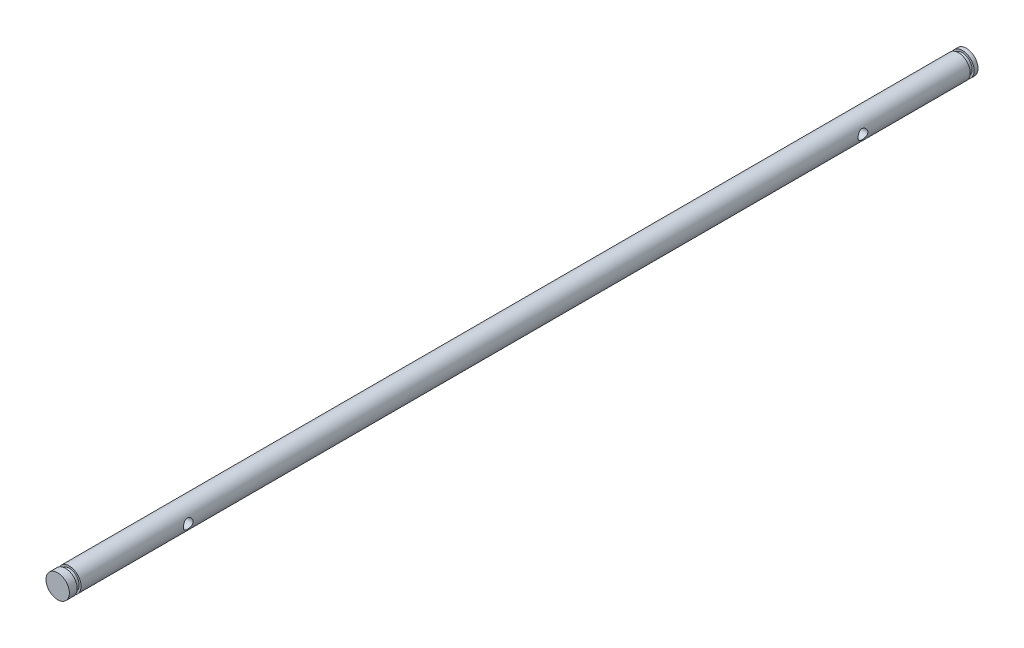
ISO-10303-21;
HEADER;
FILE_DESCRIPTION(('STEP AP214'),'2;1');
FILE_NAME('part.step','',(''),(''),'','','');
FILE_SCHEMA(('AUTOMOTIVE_DESIGN { 1 0 10303 214 1 1 1 1 }'));
ENDSEC;
DATA;
#1=APPLICATION_CONTEXT('core data for automotive mechanical design processes');
#2=APPLICATION_PROTOCOL_DEFINITION('international standard','automotive_design',2000,#1);
#3=PRODUCT_CONTEXT('',#1,'mechanical');
#4=PRODUCT('Part','Part','',(#3));
#5=PRODUCT_RELATED_PRODUCT_CATEGORY('part','',(#4));
#6=PRODUCT_DEFINITION_FORMATION('','',#4);
#7=PRODUCT_DEFINITION_CONTEXT('part definition',#1,'design');
#8=PRODUCT_DEFINITION('design','',#6,#7);
#9=PRODUCT_DEFINITION_SHAPE('','',#8);
#10=(LENGTH_UNIT() NAMED_UNIT(*) SI_UNIT(.MILLI.,.METRE.));
#11=(NAMED_UNIT(*) PLANE_ANGLE_UNIT() SI_UNIT($,.RADIAN.));
#12=(NAMED_UNIT(*) SI_UNIT($,.STERADIAN.) SOLID_ANGLE_UNIT());
#13=UNCERTAINTY_MEASURE_WITH_UNIT(LENGTH_MEASURE(1.E-05),#10,'distance_accuracy_value','');
#14=(GEOMETRIC_REPRESENTATION_CONTEXT(3) GLOBAL_UNCERTAINTY_ASSIGNED_CONTEXT((#13)) GLOBAL_UNIT_ASSIGNED_CONTEXT((#10,
#11,#12)) REPRESENTATION_CONTEXT('',''));
#15=CARTESIAN_POINT('',(0.,0.,0.));
#16=DIRECTION('',(0.,0.,1.));
#17=DIRECTION('',(1.,0.,0.));
#18=AXIS2_PLACEMENT_3D('',#15,#16,#17);
#19=CARTESIAN_POINT('',(0.,0.,233.));
#20=DIRECTION('',(0.,0.,-1.));
#21=DIRECTION('',(-1.,0.,0.));
#22=AXIS2_PLACEMENT_3D('',#19,#20,#21);
#23=CYLINDRICAL_SURFACE('',#22,3.);
#24=CARTESIAN_POINT('',(0.,0.,230.));
#25=DIRECTION('',(0.,0.,1.));
#26=DIRECTION('',(1.,0.,0.));
#27=AXIS2_PLACEMENT_3D('',#24,#25,#26);
#28=CIRCLE('',#27,3.);
#29=CARTESIAN_POINT('',(3.,0.,230.));
#30=VERTEX_POINT('',#29);
#31=EDGE_CURVE('E138',#30,#30,#28,.T.);
#32=ORIENTED_EDGE('',*,*,#31,.F.);
#33=EDGE_LOOP('',(#32));
#34=FACE_BOUND('',#33,.T.);
#35=CARTESIAN_POINT('',(0.,0.,2.));
#36=DIRECTION('',(0.,0.,1.));
#37=DIRECTION('',(1.,0.,0.));
#38=AXIS2_PLACEMENT_3D('',#35,#36,#37);
#39=CIRCLE('',#38,3.);
#40=CARTESIAN_POINT('',(3.,0.,2.));
#41=VERTEX_POINT('',#40);
#42=EDGE_CURVE('E154',#41,#41,#39,.T.);
#43=ORIENTED_EDGE('',*,*,#42,.T.);
#44=EDGE_LOOP('',(#43));
#45=FACE_BOUND('',#44,.T.);
#46=CARTESIAN_POINT('',(3.,0.,201.25));
#47=CARTESIAN_POINT('',(2.99999458367273,-0.0669580526362911,201.250007205091));
#48=CARTESIAN_POINT('',(2.9977323297471,-0.134021397063864,201.255411958528));
#49=CARTESIAN_POINT('',(2.98890153579551,-0.26624737115637,201.27683906492));
#50=CARTESIAN_POINT('',(2.98232175901027,-0.331404576423587,201.292889124464));
#51=CARTESIAN_POINT('',(2.96556289038127,-0.457688733653108,201.334911091781));
#52=CARTESIAN_POINT('',(2.95539599975003,-0.518828524426287,201.360849389468));
#53=CARTESIAN_POINT('',(2.93245286470664,-0.635829756679822,201.421772823233));
#54=CARTESIAN_POINT('',(2.91967741092849,-0.691692790015963,201.456755218971));
#55=CARTESIAN_POINT('',(2.89207828351868,-0.799448403559525,201.536628982591));
#56=CARTESIAN_POINT('',(2.87718753326093,-0.851041267517771,201.58190130879));
#57=CARTESIAN_POINT('',(2.84732714068513,-0.946159821091268,201.680264334783));
#58=CARTESIAN_POINT('',(2.83235746106809,-0.989681263153102,201.733359124894));
#59=CARTESIAN_POINT('',(2.80321021812994,-1.06953737697068,201.849026777565));
#60=CARTESIAN_POINT('',(2.78910786873384,-1.10541308153927,201.911937448426));
#61=CARTESIAN_POINT('',(2.76435572357004,-1.16593940588868,202.043573257921));
#62=CARTESIAN_POINT('',(2.75370415000822,-1.19059580836293,202.112295379484));
#63=CARTESIAN_POINT('',(2.73778555387704,-1.22674598312161,202.250153691768));
#64=CARTESIAN_POINT('',(2.73228387651786,-1.23881657877608,202.319110483392));
#65=CARTESIAN_POINT('',(2.72661326219503,-1.25125209967799,202.458273292687));
#66=CARTESIAN_POINT('',(2.72644138425259,-1.251623480544,202.528478600026));
#67=CARTESIAN_POINT('',(2.73125119560852,-1.24108450363676,202.662400060435));
#68=CARTESIAN_POINT('',(2.73583882723622,-1.23103681112303,202.726201096564));
#69=CARTESIAN_POINT('',(2.74898482773795,-1.20139191015779,202.851112091));
#70=CARTESIAN_POINT('',(2.75754395703562,-1.1817928728718,202.912221531492));
#71=CARTESIAN_POINT('',(2.77786184772755,-1.13321958727574,203.031557702991));
#72=CARTESIAN_POINT('',(2.78968481949135,-1.10405471539238,203.089695420913));
#73=CARTESIAN_POINT('',(2.81518331141085,-1.03731242580564,203.20047773388));
#74=CARTESIAN_POINT('',(2.82885956129779,-0.999731690519563,203.253120150614));
#75=CARTESIAN_POINT('',(2.85792976877979,-0.913495965543848,203.356099958733));
#76=CARTESIAN_POINT('',(2.87337121404473,-0.864173483207531,203.405866567385));
#77=CARTESIAN_POINT('',(2.90325673112529,-0.757729591051516,203.496613502959));
#78=CARTESIAN_POINT('',(2.9177005687701,-0.700606359448469,203.537591771692));
#79=CARTESIAN_POINT('',(2.94438283556473,-0.578447948693395,203.610435823616));
#80=CARTESIAN_POINT('',(2.95656266543333,-0.513260582447696,203.642069445151));
#81=CARTESIAN_POINT('',(2.97689481414803,-0.377852402526852,203.693721139603));
#82=CARTESIAN_POINT('',(2.985049358458,-0.307634394795061,203.713745631944));
#83=CARTESIAN_POINT('',(2.99599641186385,-0.168928113346258,203.740415992127));
#84=CARTESIAN_POINT('',(2.99909541047125,-0.100611285278667,203.747827857444));
#85=CARTESIAN_POINT('',(3.00056050368745,0.036354655496066,203.751346223614));
#86=CARTESIAN_POINT('',(2.99892795711939,0.105003667152615,203.747455970252));
#87=CARTESIAN_POINT('',(2.9913121765694,0.237098242341413,203.729028915194));
#88=CARTESIAN_POINT('',(2.9855488728399,0.30063296663936,203.715030045903));
#89=CARTESIAN_POINT('',(2.97048606772415,0.424382748971065,203.677531805459));
#90=CARTESIAN_POINT('',(2.96118611959704,0.48459738651834,203.65403123405));
#91=CARTESIAN_POINT('',(2.93958270645166,0.602108999869118,203.597429024288));
#92=CARTESIAN_POINT('',(2.92719491469282,0.659257236855303,203.564051816854));
#93=CARTESIAN_POINT('',(2.90073804579091,0.767346216231407,203.488946622208));
#94=CARTESIAN_POINT('',(2.88666826768734,0.818284352601922,203.447215148471));
#95=CARTESIAN_POINT('',(2.85712087895438,0.916333430274247,203.353096766728));
#96=CARTESIAN_POINT('',(2.8416145159103,0.962910697979816,203.300161497014));
#97=CARTESIAN_POINT('',(2.81184336768006,1.04666984610549,203.186978724065));
#98=CARTESIAN_POINT('',(2.79757886493439,1.08384959285615,203.126729564828));
#99=CARTESIAN_POINT('',(2.77181386243989,1.14815960208697,202.999385824697));
#100=CARTESIAN_POINT('',(2.76035562555113,1.17513918237326,202.932205964485));
#101=CARTESIAN_POINT('',(2.74208355658958,1.2171741395157,202.79362940619));
#102=CARTESIAN_POINT('',(2.73526589555753,1.23223934863685,202.722236237517));
#103=CARTESIAN_POINT('',(2.72763164537265,1.24904080348898,202.583181300801));
#104=CARTESIAN_POINT('',(2.72639350967164,1.25171380413127,202.515655337707));
#105=CARTESIAN_POINT('',(2.72893853011025,1.2461557552391,202.381157138859));
#106=CARTESIAN_POINT('',(2.73272091540308,1.23792637964719,202.314184819686));
#107=CARTESIAN_POINT('',(2.74449551302269,1.21158404780489,202.185907252531));
#108=CARTESIAN_POINT('',(2.75228354846481,1.19394903571464,202.124483326537));
#109=CARTESIAN_POINT('',(2.7710318119919,1.14976328202133,202.005451978643));
#110=CARTESIAN_POINT('',(2.78199293131694,1.1232100351725,201.947845634601));
#111=CARTESIAN_POINT('',(2.80666954560014,1.06010285935487,201.834304104051));
#112=CARTESIAN_POINT('',(2.8205110271368,1.02304360910482,201.778677669832));
#113=CARTESIAN_POINT('',(2.84903689053839,0.940684072630386,201.674139860639));
#114=CARTESIAN_POINT('',(2.86372156345875,0.895380928905613,201.625230824399));
#115=CARTESIAN_POINT('',(2.89356392850107,0.793902045778812,201.531851318315));
#116=CARTESIAN_POINT('',(2.90867817511792,0.737174739949016,201.487963567159));
#117=CARTESIAN_POINT('',(2.9366014362202,0.616600079253177,201.410300546456));
#118=CARTESIAN_POINT('',(2.94940939916741,0.552749497945717,201.37652988511));
#119=CARTESIAN_POINT('',(2.97109183362461,0.420732056717916,201.32079015456));
#120=CARTESIAN_POINT('',(2.98002782581964,0.352653990980603,201.298635233383));
#121=CARTESIAN_POINT('',(2.99321009768625,0.21341042184653,201.266293670922));
#122=CARTESIAN_POINT('',(2.99747105811967,0.142255316980932,201.25606955747));
#123=CARTESIAN_POINT('',(2.99972287568934,0.0472360819191591,201.250666838914));
#124=CARTESIAN_POINT('',(3.00000191102536,0.0236245946756326,201.249997457851));
#125=CARTESIAN_POINT('',(3.,0.,201.25));
#126=B_SPLINE_CURVE_WITH_KNOTS('',3,(#46,#47,#48,#49,#50,#51,#52,#53,#54,#55,#56,#57,#58,#59,
#60,#61,#62,#63,#64,#65,#66,#67,#68,#69,#70,#71,#72,#73,#74,#75,#76,#77,#78,#79,#80,#81,#82,#83,
#84,#85,#86,#87,#88,#89,#90,#91,#92,#93,#94,#95,#96,#97,#98,#99,#100,#101,#102,#103,#104,#105,
#106,#107,#108,#109,#110,#111,#112,#113,#114,#115,#116,#117,#118,#119,#120,#121,#122,#123,#124,
#125),.UNSPECIFIED.,.T.,.F.,(4,2,2,2,2,2,2,2,2,2,2,2,2,2,2,2,2,2,2,2,2,2,2,2,2,2,2,2,2,2,2,2,2,
2,2,2,2,2,2,4),(0.,0.200806918883936,0.402138540628699,0.602791851906281,0.803384436852979,
1.01317936288803,1.22308438131465,1.44331724539123,1.66343646730589,1.87295273137559,
2.08235338249048,2.27570157202556,2.46908679727212,2.66658713058714,2.86416545717208,
3.07844141127899,3.2927674931459,3.51204055060814,3.73119224218297,3.93648443393251,
4.14171767493173,4.33676589735722,4.53183876601786,4.73297135272162,4.93418805469497,
5.14978488029296,5.36543061240343,5.58414788359521,5.80268447074579,6.00439877559638,
6.20608211297534,6.39837649964761,6.59072494950611,6.79463893397438,6.9986237342594,
7.21746535004887,7.43640649428582,7.65172855819385,7.8663725046932,7.93722256499097),.UNSPECIFIED.);
#127=CARTESIAN_POINT('',(3.,0.,201.25));
#128=VERTEX_POINT('',#127);
#129=EDGE_CURVE('E68',#128,#128,#126,.T.);
#130=ORIENTED_EDGE('',*,*,#129,.T.);
#131=EDGE_LOOP('',(#130));
#132=FACE_BOUND('',#131,.T.);
#133=CARTESIAN_POINT('',(-3.,0.,201.25));
#134=CARTESIAN_POINT('',(-2.99999458367273,0.0669580526362413,201.250007205091));
#135=CARTESIAN_POINT('',(-2.9977323297471,0.134021397063814,201.255411958528));
#136=CARTESIAN_POINT('',(-2.98890153579552,0.26624737115632,201.27683906492));
#137=CARTESIAN_POINT('',(-2.98232175901028,0.331404576423538,201.292889124464));
#138=CARTESIAN_POINT('',(-2.96556289038128,0.457688733653061,201.334911091781));
#139=CARTESIAN_POINT('',(-2.95539599975004,0.51882852442624,201.360849389468));
#140=CARTESIAN_POINT('',(-2.93245286470665,0.635829756679772,201.421772823233));
#141=CARTESIAN_POINT('',(-2.9196774109285,0.69169279001591,201.456755218971));
#142=CARTESIAN_POINT('',(-2.8920782835187,0.799448403559482,201.536628982591));
#143=CARTESIAN_POINT('',(-2.87718753326094,0.851041267517737,201.58190130879));
#144=CARTESIAN_POINT('',(-2.84732714068515,0.946159821091232,201.680264334783));
#145=CARTESIAN_POINT('',(-2.8323574610681,0.989681263153059,201.733359124894));
#146=CARTESIAN_POINT('',(-2.80321021812996,1.06953737697063,201.849026777565));
#147=CARTESIAN_POINT('',(-2.78910786873386,1.10541308153922,201.911937448426));
#148=CARTESIAN_POINT('',(-2.76435572357006,1.16593940588863,202.043573257921));
#149=CARTESIAN_POINT('',(-2.75370415000825,1.19059580836288,202.112295379484));
#150=CARTESIAN_POINT('',(-2.73778555387706,1.22674598312156,202.250153691768));
#151=CARTESIAN_POINT('',(-2.73228387651788,1.23881657877603,202.319110483392));
#152=CARTESIAN_POINT('',(-2.72661326219505,1.25125209967794,202.458273292687));
#153=CARTESIAN_POINT('',(-2.72644138425261,1.25162348054395,202.528478600026));
#154=CARTESIAN_POINT('',(-2.73125119560854,1.24108450363671,202.662400060435));
#155=CARTESIAN_POINT('',(-2.73583882723624,1.23103681112298,202.726201096564));
#156=CARTESIAN_POINT('',(-2.74898482773797,1.20139191015774,202.851112091));
#157=CARTESIAN_POINT('',(-2.75754395703565,1.18179287287175,202.912221531492));
#158=CARTESIAN_POINT('',(-2.77786184772757,1.13321958727569,203.031557702991));
#159=CARTESIAN_POINT('',(-2.78968481949137,1.10405471539233,203.089695420913));
#160=CARTESIAN_POINT('',(-2.81518331141087,1.03731242580559,203.20047773388));
#161=CARTESIAN_POINT('',(-2.82885956129781,0.999731690519514,203.253120150614));
#162=CARTESIAN_POINT('',(-2.8579297687798,0.913495965543798,203.356099958733));
#163=CARTESIAN_POINT('',(-2.87337121404474,0.864173483207481,203.405866567385));
#164=CARTESIAN_POINT('',(-2.90325673112531,0.757729591051467,203.496613502959));
#165=CARTESIAN_POINT('',(-2.91770056877011,0.700606359448419,203.537591771692));
#166=CARTESIAN_POINT('',(-2.94438283556474,0.578447948693345,203.610435823616));
#167=CARTESIAN_POINT('',(-2.95656266543334,0.513260582447646,203.642069445151));
#168=CARTESIAN_POINT('',(-2.97689481414804,0.377852402526802,203.693721139603));
#169=CARTESIAN_POINT('',(-2.985049358458,0.307634394795011,203.713745631944));
#170=CARTESIAN_POINT('',(-2.99599641186385,0.168928113346208,203.740415992127));
#171=CARTESIAN_POINT('',(-2.99909541047125,0.100611285278617,203.747827857444));
#172=CARTESIAN_POINT('',(-3.00056050368745,-0.0363546554961161,203.751346223614));
#173=CARTESIAN_POINT('',(-2.99892795711939,-0.105003667152665,203.747455970252));
#174=CARTESIAN_POINT('',(-2.9913121765694,-0.237098242341462,203.729028915194));
#175=CARTESIAN_POINT('',(-2.98554887283989,-0.300632966639409,203.715030045903));
#176=CARTESIAN_POINT('',(-2.97048606772414,-0.424382748971113,203.677531805459));
#177=CARTESIAN_POINT('',(-2.96118611959703,-0.484597386518388,203.65403123405));
#178=CARTESIAN_POINT('',(-2.93958270645165,-0.602108999869171,203.597429024288));
#179=CARTESIAN_POINT('',(-2.92719491469281,-0.659257236855361,203.564051816854));
#180=CARTESIAN_POINT('',(-2.90073804579089,-0.767346216231466,203.488946622208));
#181=CARTESIAN_POINT('',(-2.88666826768732,-0.818284352601975,203.447215148471));
#182=CARTESIAN_POINT('',(-2.85712087895437,-0.916333430274295,203.353096766728));
#183=CARTESIAN_POINT('',(-2.84161451591028,-0.962910697979865,203.300161497014));
#184=CARTESIAN_POINT('',(-2.81184336768004,-1.04666984610554,203.186978724065));
#185=CARTESIAN_POINT('',(-2.79757886493437,-1.0838495928562,203.126729564828));
#186=CARTESIAN_POINT('',(-2.77181386243987,-1.14815960208702,202.999385824697));
#187=CARTESIAN_POINT('',(-2.76035562555111,-1.17513918237331,202.932205964485));
#188=CARTESIAN_POINT('',(-2.74208355658956,-1.21717413951575,202.79362940619));
#189=CARTESIAN_POINT('',(-2.73526589555751,-1.2322393486369,202.722236237517));
#190=CARTESIAN_POINT('',(-2.72763164537263,-1.24904080348903,202.583181300801));
#191=CARTESIAN_POINT('',(-2.72639350967162,-1.25171380413132,202.515655337707));
#192=CARTESIAN_POINT('',(-2.72893853011023,-1.24615575523915,202.381157138859));
#193=CARTESIAN_POINT('',(-2.73272091540305,-1.23792637964724,202.314184819686));
#194=CARTESIAN_POINT('',(-2.74449551302267,-1.21158404780494,202.185907252531));
#195=CARTESIAN_POINT('',(-2.75228354846479,-1.19394903571469,202.124483326537));
#196=CARTESIAN_POINT('',(-2.77103181199188,-1.14976328202138,202.005451978643));
#197=CARTESIAN_POINT('',(-2.78199293131692,-1.12321003517255,201.947845634601));
#198=CARTESIAN_POINT('',(-2.80666954560012,-1.06010285935492,201.834304104051));
#199=CARTESIAN_POINT('',(-2.82051102713678,-1.02304360910486,201.778677669832));
#200=CARTESIAN_POINT('',(-2.84903689053838,-0.940684072630427,201.674139860639));
#201=CARTESIAN_POINT('',(-2.86372156345874,-0.895380928905658,201.625230824399));
#202=CARTESIAN_POINT('',(-2.89356392850105,-0.793902045778861,201.531851318315));
#203=CARTESIAN_POINT('',(-2.90867817511791,-0.737174739949065,201.487963567159));
#204=CARTESIAN_POINT('',(-2.93660143622019,-0.616600079253228,201.410300546456));
#205=CARTESIAN_POINT('',(-2.9494093991674,-0.552749497945769,201.37652988511));
#206=CARTESIAN_POINT('',(-2.9710918336246,-0.420732056717968,201.32079015456));
#207=CARTESIAN_POINT('',(-2.98002782581964,-0.352653990980654,201.298635233383));
#208=CARTESIAN_POINT('',(-2.99321009768624,-0.213410421846582,201.266293670922));
#209=CARTESIAN_POINT('',(-2.99747105811967,-0.142255316980984,201.25606955747));
#210=CARTESIAN_POINT('',(-2.99972287568934,-0.0472360819192105,201.250666838914));
#211=CARTESIAN_POINT('',(-3.00000191102536,-0.0236245946756831,201.249997457851));
#212=CARTESIAN_POINT('',(-3.,0.,201.25));
#213=B_SPLINE_CURVE_WITH_KNOTS('',3,(#133,#134,#135,#136,#137,#138,#139,#140,#141,#142,#143,
#144,#145,#146,#147,#148,#149,#150,#151,#152,#153,#154,#155,#156,#157,#158,#159,#160,#161,#162,
#163,#164,#165,#166,#167,#168,#169,#170,#171,#172,#173,#174,#175,#176,#177,#178,#179,#180,#181,
#182,#183,#184,#185,#186,#187,#188,#189,#190,#191,#192,#193,#194,#195,#196,#197,#198,#199,#200,
#201,#202,#203,#204,#205,#206,#207,#208,#209,#210,#211,#212),.UNSPECIFIED.,.T.,.F.,(4,2,2,2,2,2,
2,2,2,2,2,2,2,2,2,2,2,2,2,2,2,2,2,2,2,2,2,2,2,2,2,2,2,2,2,2,2,2,2,4),(0.,0.200806918883936,
0.402138540628698,0.602791851906298,0.803384436852968,1.01317936288806,1.22308438131465,
1.44331724539122,1.66343646730588,1.87295273137558,2.08235338249047,2.27570157202556,
2.46908679727211,2.66658713058713,2.86416545717207,3.07844141127898,3.29276749314589,
3.51204055060813,3.73119224218296,3.9364844339325,4.14171767493172,4.33676589735721,
4.53183876601784,4.73297135272162,4.93418805469496,5.14978488029295,5.36543061240342,
5.5841478835952,5.80268447074578,6.00439877559637,6.20608211297534,6.3983764996476,
6.59072494950611,6.7946389339744,6.9986237342594,7.21746535004887,7.43640649428582,
7.65172855819384,7.8663725046932,7.93722256499097),.UNSPECIFIED.);
#214=CARTESIAN_POINT('',(-3.,0.,201.25));
#215=VERTEX_POINT('',#214);
#216=EDGE_CURVE('E50',#215,#215,#213,.T.);
#217=ORIENTED_EDGE('',*,*,#216,.T.);
#218=EDGE_LOOP('',(#217));
#219=FACE_BOUND('',#218,.T.);
#220=CARTESIAN_POINT('',(3.,0.,28.25));
#221=CARTESIAN_POINT('',(2.99999458367273,-0.0669580526362709,28.2500072050913));
#222=CARTESIAN_POINT('',(2.9977323297471,-0.134021397063845,28.2554119585281));
#223=CARTESIAN_POINT('',(2.98890153579552,-0.266247371156351,28.2768390649202));
#224=CARTESIAN_POINT('',(2.98232175901028,-0.331404576423568,28.2928891244642));
#225=CARTESIAN_POINT('',(2.96556289038127,-0.457688733653091,28.3349110917806));
#226=CARTESIAN_POINT('',(2.95539599975004,-0.518828524426271,28.3608493894681));
#227=CARTESIAN_POINT('',(2.93245286470664,-0.635829756679805,28.4217728232326));
#228=CARTESIAN_POINT('',(2.91967741092849,-0.691692790015943,28.4567552189709));
#229=CARTESIAN_POINT('',(2.89207828351869,-0.799448403559517,28.5366289825909));
#230=CARTESIAN_POINT('',(2.87718753326093,-0.851041267517774,28.5819013087897));
#231=CARTESIAN_POINT('',(2.84732714068513,-0.946159821091268,28.6802643347826));
#232=CARTESIAN_POINT('',(2.83235746106809,-0.98968126315309,28.7333591248945));
#233=CARTESIAN_POINT('',(2.80321021812995,-1.06953737697066,28.8490267775649));
#234=CARTESIAN_POINT('',(2.78910786873385,-1.10541308153926,28.9119374484265));
#235=CARTESIAN_POINT('',(2.76435572357005,-1.16593940588866,29.0435732579209));
#236=CARTESIAN_POINT('',(2.75370415000823,-1.19059580836291,29.1122953794845));
#237=CARTESIAN_POINT('',(2.73778555387705,-1.22674598312159,29.2501536917679));
#238=CARTESIAN_POINT('',(2.73228387651787,-1.23881657877606,29.3191104833922));
#239=CARTESIAN_POINT('',(2.72661326219504,-1.25125209967797,29.4582732926866));
#240=CARTESIAN_POINT('',(2.7264413842526,-1.25162348054398,29.5284786000257));
#241=CARTESIAN_POINT('',(2.73125119560852,-1.24108450363674,29.6624000604349));
#242=CARTESIAN_POINT('',(2.73583882723623,-1.23103681112301,29.7262010965645));
#243=CARTESIAN_POINT('',(2.74898482773796,-1.20139191015777,29.8511120910004));
#244=CARTESIAN_POINT('',(2.75754395703564,-1.18179287287177,29.9122215314918));
#245=CARTESIAN_POINT('',(2.77786184772756,-1.13321958727571,30.0315577029914));
#246=CARTESIAN_POINT('',(2.78968481949136,-1.10405471539236,30.0896954209134));
#247=CARTESIAN_POINT('',(2.81518331141086,-1.03731242580563,30.2004777338801));
#248=CARTESIAN_POINT('',(2.82885956129779,-0.999731690519547,30.2531201506135));
#249=CARTESIAN_POINT('',(2.85792976877979,-0.913495965543838,30.3560999587328));
#250=CARTESIAN_POINT('',(2.87337121404473,-0.864173483207529,30.4058665673854));
#251=CARTESIAN_POINT('',(2.90325673112529,-0.757729591051514,30.4966135029592));
#252=CARTESIAN_POINT('',(2.9177005687701,-0.700606359448458,30.5375917716922));
#253=CARTESIAN_POINT('',(2.94438283556473,-0.578447948693379,30.6104358236163));
#254=CARTESIAN_POINT('',(2.95656266543334,-0.513260582447684,30.6420694451507));
#255=CARTESIAN_POINT('',(2.97689481414803,-0.377852402526836,30.6937211396033));
#256=CARTESIAN_POINT('',(2.985049358458,-0.307634394795039,30.7137456319438));
#257=CARTESIAN_POINT('',(2.99599641186385,-0.168928113346232,30.7404159921266));
#258=CARTESIAN_POINT('',(2.99909541047125,-0.100611285278643,30.7478278574437));
#259=CARTESIAN_POINT('',(3.00056050368745,0.036354655496085,30.7513462236141));
#260=CARTESIAN_POINT('',(2.99892795711939,0.105003667152632,30.747455970252));
#261=CARTESIAN_POINT('',(2.9913121765694,0.237098242341431,30.7290289151939));
#262=CARTESIAN_POINT('',(2.9855488728399,0.300632966639382,30.7150300459028));
#263=CARTESIAN_POINT('',(2.97048606772414,0.424382748971087,30.6775318054592));
#264=CARTESIAN_POINT('',(2.96118611959704,0.484597386518357,30.6540312340497));
#265=CARTESIAN_POINT('',(2.93958270645166,0.602108999869134,30.5974290242879));
#266=CARTESIAN_POINT('',(2.92719491469281,0.659257236855321,30.564051816854));
#267=CARTESIAN_POINT('',(2.9007380457909,0.767346216231426,30.4889466222083));
#268=CARTESIAN_POINT('',(2.88666826768733,0.818284352601938,30.4472151484707));
#269=CARTESIAN_POINT('',(2.85712087895438,0.916333430274261,30.3530967667276));
#270=CARTESIAN_POINT('',(2.84161451591029,0.962910697979832,30.3001614970137));
#271=CARTESIAN_POINT('',(2.81184336768005,1.0466698461055,30.1869787240646));
#272=CARTESIAN_POINT('',(2.79757886493439,1.08384959285617,30.1267295648283));
#273=CARTESIAN_POINT('',(2.77181386243988,1.14815960208699,29.9993858246974));
#274=CARTESIAN_POINT('',(2.76035562555112,1.17513918237328,29.9322059644852));
#275=CARTESIAN_POINT('',(2.74208355658957,1.21717413951572,29.7936294061899));
#276=CARTESIAN_POINT('',(2.73526589555752,1.23223934863687,29.7222362375167));
#277=CARTESIAN_POINT('',(2.72763164537264,1.249040803489,29.5831813008008));
#278=CARTESIAN_POINT('',(2.72639350967163,1.25171380413129,29.5156553377074));
#279=CARTESIAN_POINT('',(2.72893853011024,1.24615575523912,29.3811571388589));
#280=CARTESIAN_POINT('',(2.73272091540307,1.23792637964721,29.3141848196863));
#281=CARTESIAN_POINT('',(2.74449551302268,1.21158404780491,29.1859072525311));
#282=CARTESIAN_POINT('',(2.75228354846481,1.19394903571466,29.1244833265366));
#283=CARTESIAN_POINT('',(2.77103181199189,1.14976328202134,29.0054519786428));
#284=CARTESIAN_POINT('',(2.78199293131694,1.12321003517251,28.9478456346012));
#285=CARTESIAN_POINT('',(2.80666954560013,1.06010285935489,28.8343041040509));
#286=CARTESIAN_POINT('',(2.8205110271368,1.02304360910483,28.7786776698317));
#287=CARTESIAN_POINT('',(2.84903689053839,0.940684072630386,28.6741398606393));
#288=CARTESIAN_POINT('',(2.86372156345875,0.895380928905614,28.6252308243994));
#289=CARTESIAN_POINT('',(2.89356392850106,0.793902045778816,28.5318513183153));
#290=CARTESIAN_POINT('',(2.90867817511792,0.737174739949022,28.4879635671593));
#291=CARTESIAN_POINT('',(2.9366014362202,0.616600079253193,28.4103005464564));
#292=CARTESIAN_POINT('',(2.9494093991674,0.552749497945739,28.3765298851104));
#293=CARTESIAN_POINT('',(2.97109183362461,0.420732056717944,28.3207901545601));
#294=CARTESIAN_POINT('',(2.98002782581964,0.352653990980629,28.2986352333827));
#295=CARTESIAN_POINT('',(2.99321009768625,0.213410421846552,28.2662936709222));
#296=CARTESIAN_POINT('',(2.99747105811967,0.142255316980951,28.2560695574701));
#297=CARTESIAN_POINT('',(2.99972287568934,0.0472360819191779,28.2506668389136));
#298=CARTESIAN_POINT('',(3.00000191102536,0.0236245946756524,28.2499974578508));
#299=CARTESIAN_POINT('',(3.,0.,28.25));
#300=B_SPLINE_CURVE_WITH_KNOTS('',3,(#220,#221,#222,#223,#224,#225,#226,#227,#228,#229,#230,
#231,#232,#233,#234,#235,#236,#237,#238,#239,#240,#241,#242,#243,#244,#245,#246,#247,#248,#249,
#250,#251,#252,#253,#254,#255,#256,#257,#258,#259,#260,#261,#262,#263,#264,#265,#266,#267,#268,
#269,#270,#271,#272,#273,#274,#275,#276,#277,#278,#279,#280,#281,#282,#283,#284,#285,#286,#287,
#288,#289,#290,#291,#292,#293,#294,#295,#296,#297,#298,#299),.UNSPECIFIED.,.T.,.F.,(4,2,2,2,2,2,
2,2,2,2,2,2,2,2,2,2,2,2,2,2,2,2,2,2,2,2,2,2,2,2,2,2,2,2,2,2,2,2,2,4),(0.,0.200806918883939,
0.402138540628697,0.602791851906299,0.803384436852974,1.01317936288807,1.22308438131466,
1.44331724539126,1.66343646730588,1.87295273137558,2.08235338249046,2.27570157202556,
2.46908679727213,2.66658713058715,2.86416545717206,3.07844141127897,3.29276749314588,
3.51204055060813,3.73119224218297,3.93648443393251,4.14171767493172,4.33676589735721,
4.53183876601785,4.73297135272161,4.93418805469496,5.14978488029294,5.36543061240341,
5.58414788359523,5.8026844707458,6.00439877559644,6.20608211297536,6.39837649964762,
6.59072494950613,6.79463893397441,6.99862373425944,7.21746535004889,7.43640649428582,
7.65172855819385,7.86637250469321,7.93722256499098),.UNSPECIFIED.);
#301=CARTESIAN_POINT('',(3.,0.,28.25));
#302=VERTEX_POINT('',#301);
#303=EDGE_CURVE('E73',#302,#302,#300,.T.);
#304=ORIENTED_EDGE('',*,*,#303,.T.);
#305=EDGE_LOOP('',(#304));
#306=FACE_BOUND('',#305,.T.);
#307=CARTESIAN_POINT('',(-3.,0.,28.25));
#308=CARTESIAN_POINT('',(-2.99999458367273,0.066958052636263,28.2500072050913));
#309=CARTESIAN_POINT('',(-2.9977323297471,0.134021397063838,28.2554119585281));
#310=CARTESIAN_POINT('',(-2.98890153579552,0.266247371156344,28.2768390649202));
#311=CARTESIAN_POINT('',(-2.98232175901028,0.33140457642356,28.2928891244642));
#312=CARTESIAN_POINT('',(-2.96556289038127,0.457688733653084,28.3349110917806));
#313=CARTESIAN_POINT('',(-2.95539599975004,0.518828524426265,28.3608493894681));
#314=CARTESIAN_POINT('',(-2.93245286470664,0.635829756679799,28.4217728232326));
#315=CARTESIAN_POINT('',(-2.91967741092849,0.691692790015936,28.4567552189709));
#316=CARTESIAN_POINT('',(-2.89207828351869,0.799448403559507,28.5366289825909));
#317=CARTESIAN_POINT('',(-2.87718753326093,0.851041267517762,28.5819013087897));
#318=CARTESIAN_POINT('',(-2.84732714068514,0.946159821091256,28.6802643347826));
#319=CARTESIAN_POINT('',(-2.8323574610681,0.98968126315308,28.7333591248945));
#320=CARTESIAN_POINT('',(-2.80321021812995,1.06953737697065,28.8490267775649));
#321=CARTESIAN_POINT('',(-2.78910786873385,1.10541308153925,28.9119374484265));
#322=CARTESIAN_POINT('',(-2.76435572357005,1.16593940588865,29.0435732579209));
#323=CARTESIAN_POINT('',(-2.75370415000824,1.1905958083629,29.1122953794845));
#324=CARTESIAN_POINT('',(-2.73778555387705,1.22674598312158,29.2501536917679));
#325=CARTESIAN_POINT('',(-2.73228387651787,1.23881657877605,29.3191104833922));
#326=CARTESIAN_POINT('',(-2.72661326219504,1.25125209967796,29.4582732926866));
#327=CARTESIAN_POINT('',(-2.7264413842526,1.25162348054397,29.5284786000257));
#328=CARTESIAN_POINT('',(-2.73125119560853,1.24108450363673,29.6624000604349));
#329=CARTESIAN_POINT('',(-2.73583882723623,1.231036811123,29.7262010965645));
#330=CARTESIAN_POINT('',(-2.74898482773797,1.20139191015776,29.8511120910004));
#331=CARTESIAN_POINT('',(-2.75754395703564,1.18179287287176,29.9122215314918));
#332=CARTESIAN_POINT('',(-2.77786184772757,1.1332195872757,30.0315577029914));
#333=CARTESIAN_POINT('',(-2.78968481949136,1.10405471539235,30.0896954209134));
#334=CARTESIAN_POINT('',(-2.81518331141086,1.03731242580562,30.2004777338801));
#335=CARTESIAN_POINT('',(-2.8288595612978,0.99973169051954,30.2531201506135));
#336=CARTESIAN_POINT('',(-2.85792976877979,0.913495965543831,30.3560999587328));
#337=CARTESIAN_POINT('',(-2.87337121404473,0.864173483207521,30.4058665673854));
#338=CARTESIAN_POINT('',(-2.90325673112529,0.757729591051506,30.4966135029592));
#339=CARTESIAN_POINT('',(-2.9177005687701,0.700606359448451,30.5375917716922));
#340=CARTESIAN_POINT('',(-2.94438283556473,0.57844794869337,30.6104358236163));
#341=CARTESIAN_POINT('',(-2.95656266543334,0.513260582447675,30.6420694451507));
#342=CARTESIAN_POINT('',(-2.97689481414803,0.377852402526827,30.6937211396033));
#343=CARTESIAN_POINT('',(-2.985049358458,0.30763439479503,30.7137456319438));
#344=CARTESIAN_POINT('',(-2.99599641186385,0.168928113346223,30.7404159921266));
#345=CARTESIAN_POINT('',(-2.99909541047125,0.100611285278635,30.7478278574437));
#346=CARTESIAN_POINT('',(-3.00056050368745,-0.0363546554960933,30.7513462236141));
#347=CARTESIAN_POINT('',(-2.99892795711939,-0.10500366715264,30.747455970252));
#348=CARTESIAN_POINT('',(-2.9913121765694,-0.237098242341439,30.7290289151939));
#349=CARTESIAN_POINT('',(-2.9855488728399,-0.30063296663939,30.7150300459028));
#350=CARTESIAN_POINT('',(-2.97048606772414,-0.424382748971095,30.6775318054592));
#351=CARTESIAN_POINT('',(-2.96118611959704,-0.484597386518366,30.6540312340497));
#352=CARTESIAN_POINT('',(-2.93958270645166,-0.602108999869141,30.5974290242879));
#353=CARTESIAN_POINT('',(-2.92719491469281,-0.659257236855329,30.564051816854));
#354=CARTESIAN_POINT('',(-2.9007380457909,-0.767346216231434,30.4889466222083));
#355=CARTESIAN_POINT('',(-2.88666826768733,-0.818284352601946,30.4472151484707));
#356=CARTESIAN_POINT('',(-2.85712087895437,-0.916333430274269,30.3530967667276));
#357=CARTESIAN_POINT('',(-2.84161451591029,-0.96291069797984,30.3001614970137));
#358=CARTESIAN_POINT('',(-2.81184336768005,-1.04666984610551,30.1869787240646));
#359=CARTESIAN_POINT('',(-2.79757886493438,-1.08384959285618,30.1267295648283));
#360=CARTESIAN_POINT('',(-2.77181386243988,-1.148159602087,29.9993858246974));
#361=CARTESIAN_POINT('',(-2.76035562555111,-1.17513918237329,29.9322059644852));
#362=CARTESIAN_POINT('',(-2.74208355658957,-1.21717413951573,29.7936294061899));
#363=CARTESIAN_POINT('',(-2.73526589555752,-1.23223934863688,29.7222362375167));
#364=CARTESIAN_POINT('',(-2.72763164537264,-1.24904080348901,29.5831813008008));
#365=CARTESIAN_POINT('',(-2.72639350967163,-1.2517138041313,29.5156553377074));
#366=CARTESIAN_POINT('',(-2.72893853011024,-1.24615575523913,29.3811571388589));
#367=CARTESIAN_POINT('',(-2.73272091540306,-1.23792637964722,29.3141848196863));
#368=CARTESIAN_POINT('',(-2.74449551302268,-1.21158404780491,29.1859072525311));
#369=CARTESIAN_POINT('',(-2.7522835484648,-1.19394903571466,29.1244833265366));
#370=CARTESIAN_POINT('',(-2.77103181199189,-1.14976328202135,29.0054519786428));
#371=CARTESIAN_POINT('',(-2.78199293131693,-1.12321003517252,28.9478456346012));
#372=CARTESIAN_POINT('',(-2.80666954560013,-1.0601028593549,28.8343041040509));
#373=CARTESIAN_POINT('',(-2.82051102713679,-1.02304360910484,28.7786776698317));
#374=CARTESIAN_POINT('',(-2.84903689053839,-0.940684072630395,28.6741398606393));
#375=CARTESIAN_POINT('',(-2.86372156345875,-0.895380928905623,28.6252308243994));
#376=CARTESIAN_POINT('',(-2.89356392850106,-0.793902045778824,28.5318513183153));
#377=CARTESIAN_POINT('',(-2.90867817511792,-0.73717473994903,28.4879635671593));
#378=CARTESIAN_POINT('',(-2.9366014362202,-0.616600079253201,28.4103005464564));
#379=CARTESIAN_POINT('',(-2.9494093991674,-0.552749497945747,28.3765298851104));
#380=CARTESIAN_POINT('',(-2.97109183362461,-0.420732056717951,28.3207901545601));
#381=CARTESIAN_POINT('',(-2.98002782581964,-0.352653990980637,28.2986352333827));
#382=CARTESIAN_POINT('',(-2.99321009768625,-0.21341042184656,28.2662936709222));
#383=CARTESIAN_POINT('',(-2.99747105811967,-0.142255316980959,28.2560695574701));
#384=CARTESIAN_POINT('',(-2.99972287568934,-0.0472360819191854,28.2506668389136));
#385=CARTESIAN_POINT('',(-3.00000191102536,-0.0236245946756601,28.2499974578508));
#386=CARTESIAN_POINT('',(-3.,0.,28.25));
#387=B_SPLINE_CURVE_WITH_KNOTS('',3,(#307,#308,#309,#310,#311,#312,#313,#314,#315,#316,#317,
#318,#319,#320,#321,#322,#323,#324,#325,#326,#327,#328,#329,#330,#331,#332,#333,#334,#335,#336,
#337,#338,#339,#340,#341,#342,#343,#344,#345,#346,#347,#348,#349,#350,#351,#352,#353,#354,#355,
#356,#357,#358,#359,#360,#361,#362,#363,#364,#365,#366,#367,#368,#369,#370,#371,#372,#373,#374,
#375,#376,#377,#378,#379,#380,#381,#382,#383,#384,#385,#386),.UNSPECIFIED.,.T.,.F.,(4,2,2,2,2,2,
2,2,2,2,2,2,2,2,2,2,2,2,2,2,2,2,2,2,2,2,2,2,2,2,2,2,2,2,2,2,2,2,2,4),(0.,0.200806918883939,
0.402138540628697,0.602791851906301,0.803384436852974,1.01317936288806,1.22308438131465,
1.44331724539125,1.66343646730588,1.87295273137558,2.08235338249046,2.27570157202556,
2.46908679727212,2.66658713058715,2.86416545717206,3.07844141127896,3.29276749314588,
3.51204055060813,3.73119224218297,3.93648443393251,4.14171767493172,4.33676589735721,
4.53183876601785,4.73297135272161,4.93418805469496,5.14978488029294,5.36543061240341,
5.58414788359523,5.8026844707458,6.00439877559644,6.20608211297536,6.39837649964762,
6.59072494950613,6.7946389339744,6.99862373425944,7.21746535004889,7.43640649428582,
7.65172855819385,7.86637250469321,7.93722256499098),.UNSPECIFIED.);
#388=CARTESIAN_POINT('',(-3.,0.,28.25));
#389=VERTEX_POINT('',#388);
#390=EDGE_CURVE('E10',#389,#389,#387,.T.);
#391=ORIENTED_EDGE('',*,*,#390,.T.);
#392=EDGE_LOOP('',(#391));
#393=FACE_BOUND('',#392,.T.);
#394=ADVANCED_FACE('F37',(#34,#45,#132,#219,#306,#393),#23,.T.);
#395=CARTESIAN_POINT('',(3.,0.,2.));
#396=DIRECTION('',(0.,0.,1.));
#397=DIRECTION('',(1.,0.,0.));
#398=AXIS2_PLACEMENT_3D('',#395,#396,#397);
#399=PLANE('',#398);
#400=ORIENTED_EDGE('',*,*,#42,.F.);
#401=EDGE_LOOP('',(#400));
#402=FACE_BOUND('',#401,.T.);
#403=CARTESIAN_POINT('',(0.,0.,2.));
#404=DIRECTION('',(0.,0.,1.));
#405=DIRECTION('',(1.,0.,0.));
#406=AXIS2_PLACEMENT_3D('',#403,#404,#405);
#407=CIRCLE('',#406,2.5);
#408=CARTESIAN_POINT('',(2.5,0.,2.));
#409=VERTEX_POINT('',#408);
#410=EDGE_CURVE('E150',#409,#409,#407,.T.);
#411=ORIENTED_EDGE('',*,*,#410,.T.);
#412=EDGE_LOOP('',(#411));
#413=FACE_BOUND('',#412,.T.);
#414=ADVANCED_FACE('F94',(#402,#413),#399,.F.);
#415=CARTESIAN_POINT('',(0.,0.,233.));
#416=DIRECTION('',(0.,0.,1.));
#417=DIRECTION('',(1.,0.,0.));
#418=AXIS2_PLACEMENT_3D('',#415,#416,#417);
#419=CYLINDRICAL_SURFACE('',#418,2.5);
#420=ORIENTED_EDGE('',*,*,#410,.F.);
#421=EDGE_LOOP('',(#420));
#422=FACE_BOUND('',#421,.T.);
#423=CARTESIAN_POINT('',(0.,0.,1.));
#424=DIRECTION('',(0.,0.,1.));
#425=DIRECTION('',(1.,0.,0.));
#426=AXIS2_PLACEMENT_3D('',#423,#424,#425);
#427=CIRCLE('',#426,2.5);
#428=CARTESIAN_POINT('',(2.5,0.,1.));
#429=VERTEX_POINT('',#428);
#430=EDGE_CURVE('E146',#429,#429,#427,.T.);
#431=ORIENTED_EDGE('',*,*,#430,.T.);
#432=EDGE_LOOP('',(#431));
#433=FACE_BOUND('',#432,.T.);
#434=ADVANCED_FACE('F90',(#422,#433),#419,.T.);
#435=CARTESIAN_POINT('',(3.,0.,1.));
#436=DIRECTION('',(0.,0.,-1.));
#437=DIRECTION('',(-1.,0.,0.));
#438=AXIS2_PLACEMENT_3D('',#435,#436,#437);
#439=PLANE('',#438);
#440=ORIENTED_EDGE('',*,*,#430,.F.);
#441=EDGE_LOOP('',(#440));
#442=FACE_BOUND('',#441,.T.);
#443=CARTESIAN_POINT('',(0.,0.,1.));
#444=DIRECTION('',(0.,0.,1.));
#445=DIRECTION('',(1.,0.,0.));
#446=AXIS2_PLACEMENT_3D('',#443,#444,#445);
#447=CIRCLE('',#446,3.);
#448=CARTESIAN_POINT('',(3.,0.,1.));
#449=VERTEX_POINT('',#448);
#450=EDGE_CURVE('E142',#449,#449,#447,.T.);
#451=ORIENTED_EDGE('',*,*,#450,.T.);
#452=EDGE_LOOP('',(#451));
#453=FACE_BOUND('',#452,.T.);
#454=ADVANCED_FACE('F85',(#442,#453),#439,.F.);
#455=CARTESIAN_POINT('',(0.,0.,0.));
#456=DIRECTION('',(0.,0.,1.));
#457=DIRECTION('',(1.,0.,0.));
#458=AXIS2_PLACEMENT_3D('',#455,#456,#457);
#459=PLANE('',#458);
#460=CARTESIAN_POINT('',(0.,0.,0.));
#461=DIRECTION('',(0.,0.,1.));
#462=DIRECTION('',(1.,0.,0.));
#463=AXIS2_PLACEMENT_3D('',#460,#461,#462);
#464=CIRCLE('',#463,3.);
#465=CARTESIAN_POINT('',(3.,0.,0.));
#466=VERTEX_POINT('',#465);
#467=EDGE_CURVE('E61',#466,#466,#464,.T.);
#468=ORIENTED_EDGE('',*,*,#467,.F.);
#469=EDGE_LOOP('',(#468));
#470=FACE_BOUND('',#469,.T.);
#471=ADVANCED_FACE('F89',(#470),#459,.F.);
#472=ORIENTED_EDGE('',*,*,#450,.F.);
#473=EDGE_LOOP('',(#472));
#474=FACE_BOUND('',#473,.T.);
#475=ORIENTED_EDGE('',*,*,#467,.T.);
#476=EDGE_LOOP('',(#475));
#477=FACE_BOUND('',#476,.T.);
#478=ADVANCED_FACE('F39',(#474,#477),#23,.T.);
#479=CARTESIAN_POINT('',(3.7,0.,202.5));
#480=DIRECTION('',(1.,0.,0.));
#481=DIRECTION('',(0.,0.,-1.));
#482=AXIS2_PLACEMENT_3D('',#479,#480,#481);
#483=CYLINDRICAL_SURFACE('',#482,1.25);
#484=ORIENTED_EDGE('',*,*,#129,.F.);
#485=EDGE_LOOP('',(#484));
#486=FACE_BOUND('',#485,.T.);
#487=ORIENTED_EDGE('',*,*,#216,.F.);
#488=EDGE_LOOP('',(#487));
#489=FACE_BOUND('',#488,.T.);
#490=ADVANCED_FACE('F77',(#486,#489),#483,.F.);
#491=CARTESIAN_POINT('',(3.7,0.,29.5));
#492=DIRECTION('',(1.,0.,0.));
#493=DIRECTION('',(0.,0.,-1.));
#494=AXIS2_PLACEMENT_3D('',#491,#492,#493);
#495=CYLINDRICAL_SURFACE('',#494,1.25);
#496=ORIENTED_EDGE('',*,*,#303,.F.);
#497=EDGE_LOOP('',(#496));
#498=FACE_BOUND('',#497,.T.);
#499=ORIENTED_EDGE('',*,*,#390,.F.);
#500=EDGE_LOOP('',(#499));
#501=FACE_BOUND('',#500,.T.);
#502=ADVANCED_FACE('F81',(#498,#501),#495,.F.);
#503=CARTESIAN_POINT('',(3.,0.,230.));
#504=DIRECTION('',(0.,0.,-1.));
#505=DIRECTION('',(-1.,0.,0.));
#506=AXIS2_PLACEMENT_3D('',#503,#504,#505);
#507=PLANE('',#506);
#508=CARTESIAN_POINT('',(0.,0.,230.));
#509=DIRECTION('',(0.,0.,1.));
#510=DIRECTION('',(1.,0.,0.));
#511=AXIS2_PLACEMENT_3D('',#508,#509,#510);
#512=CIRCLE('',#511,2.5);
#513=CARTESIAN_POINT('',(2.5,0.,230.));
#514=VERTEX_POINT('',#513);
#515=EDGE_CURVE('E132',#514,#514,#512,.T.);
#516=ORIENTED_EDGE('',*,*,#515,.F.);
#517=EDGE_LOOP('',(#516));
#518=FACE_BOUND('',#517,.T.);
#519=ORIENTED_EDGE('',*,*,#31,.T.);
#520=EDGE_LOOP('',(#519));
#521=FACE_BOUND('',#520,.T.);
#522=ADVANCED_FACE('F169',(#518,#521),#507,.F.);
#523=CARTESIAN_POINT('',(0.,0.,233.));
#524=DIRECTION('',(0.,0.,1.));
#525=DIRECTION('',(1.,0.,0.));
#526=AXIS2_PLACEMENT_3D('',#523,#524,#525);
#527=CYLINDRICAL_SURFACE('',#526,2.5);
#528=CARTESIAN_POINT('',(0.,0.,231.));
#529=DIRECTION('',(0.,0.,1.));
#530=DIRECTION('',(1.,0.,0.));
#531=AXIS2_PLACEMENT_3D('',#528,#529,#530);
#532=CIRCLE('',#531,2.5);
#533=CARTESIAN_POINT('',(2.5,0.,231.));
#534=VERTEX_POINT('',#533);
#535=EDGE_CURVE('E128',#534,#534,#532,.T.);
#536=ORIENTED_EDGE('',*,*,#535,.F.);
#537=EDGE_LOOP('',(#536));
#538=FACE_BOUND('',#537,.T.);
#539=ORIENTED_EDGE('',*,*,#515,.T.);
#540=EDGE_LOOP('',(#539));
#541=FACE_BOUND('',#540,.T.);
#542=ADVANCED_FACE('F173',(#538,#541),#527,.T.);
#543=CARTESIAN_POINT('',(3.,0.,231.));
#544=DIRECTION('',(0.,0.,1.));
#545=DIRECTION('',(1.,0.,0.));
#546=AXIS2_PLACEMENT_3D('',#543,#544,#545);
#547=PLANE('',#546);
#548=CARTESIAN_POINT('',(0.,0.,231.));
#549=DIRECTION('',(0.,0.,1.));
#550=DIRECTION('',(1.,0.,0.));
#551=AXIS2_PLACEMENT_3D('',#548,#549,#550);
#552=CIRCLE('',#551,3.);
#553=CARTESIAN_POINT('',(3.,0.,231.));
#554=VERTEX_POINT('',#553);
#555=EDGE_CURVE('E125',#554,#554,#552,.T.);
#556=ORIENTED_EDGE('',*,*,#555,.F.);
#557=EDGE_LOOP('',(#556));
#558=FACE_BOUND('',#557,.T.);
#559=ORIENTED_EDGE('',*,*,#535,.T.);
#560=EDGE_LOOP('',(#559));
#561=FACE_BOUND('',#560,.T.);
#562=ADVANCED_FACE('F102',(#558,#561),#547,.F.);
#563=CARTESIAN_POINT('',(0.,0.,233.));
#564=DIRECTION('',(0.,0.,1.));
#565=DIRECTION('',(1.,0.,0.));
#566=AXIS2_PLACEMENT_3D('',#563,#564,#565);
#567=PLANE('',#566);
#568=CARTESIAN_POINT('',(0.,0.,233.));
#569=DIRECTION('',(0.,0.,1.));
#570=DIRECTION('',(1.,0.,0.));
#571=AXIS2_PLACEMENT_3D('',#568,#569,#570);
#572=CIRCLE('',#571,3.);
#573=CARTESIAN_POINT('',(3.,0.,233.));
#574=VERTEX_POINT('',#573);
#575=EDGE_CURVE('E55',#574,#574,#572,.T.);
#576=ORIENTED_EDGE('',*,*,#575,.T.);
#577=EDGE_LOOP('',(#576));
#578=FACE_BOUND('',#577,.T.);
#579=ADVANCED_FACE('F99',(#578),#567,.T.);
#580=ORIENTED_EDGE('',*,*,#575,.F.);
#581=EDGE_LOOP('',(#580));
#582=FACE_BOUND('',#581,.T.);
#583=ORIENTED_EDGE('',*,*,#555,.T.);
#584=EDGE_LOOP('',(#583));
#585=FACE_BOUND('',#584,.T.);
#586=ADVANCED_FACE('F101',(#582,#585),#23,.T.);
#587=CLOSED_SHELL('',(#394,#414,#434,#454,#471,#478,#490,#502,#522,#542,#562,#579,#586));
#588=MANIFOLD_SOLID_BREP('B2',#587);
#589=ADVANCED_BREP_SHAPE_REPRESENTATION('',(#18,#588),#14);
#590=SHAPE_DEFINITION_REPRESENTATION(#9,#589);
ENDSEC;
END-ISO-10303-21;
